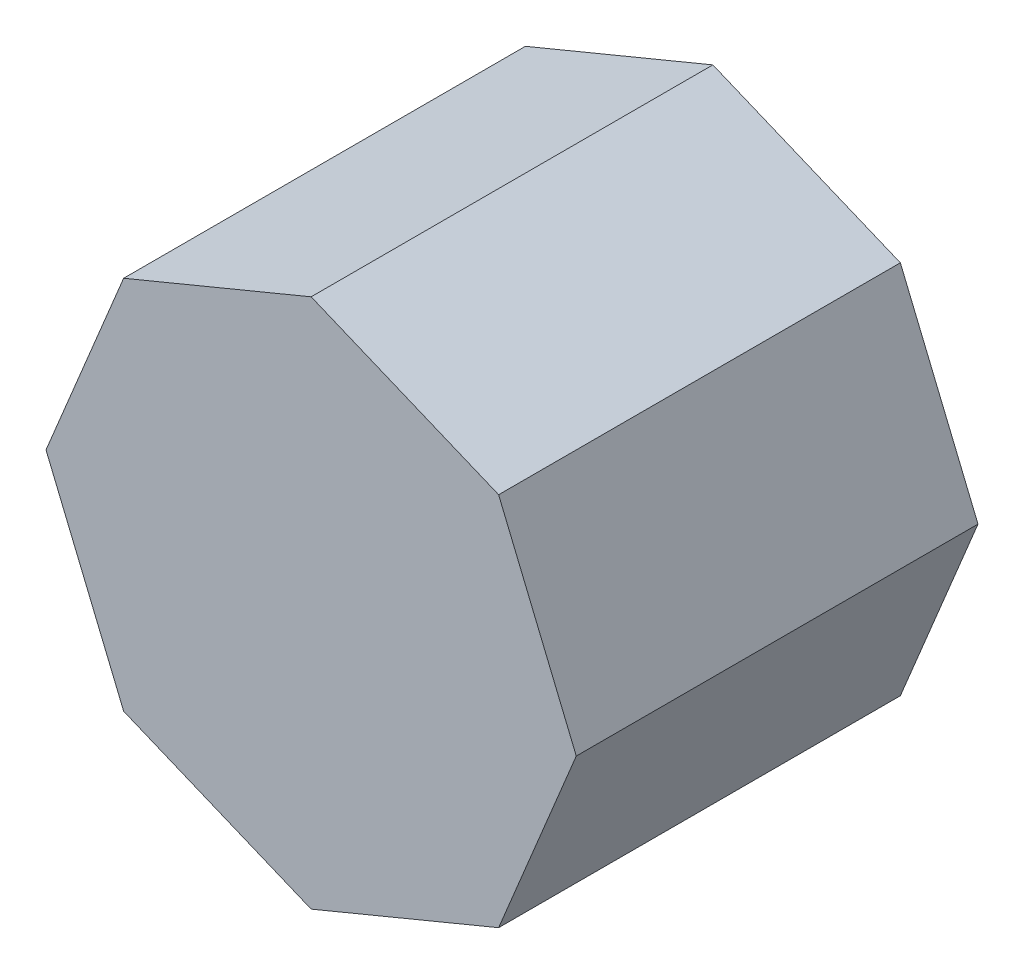
ISO-10303-21;
HEADER;
FILE_DESCRIPTION(('STEP AP214'),'2;1');
FILE_NAME('part.step','',(''),(''),'','','');
FILE_SCHEMA(('AUTOMOTIVE_DESIGN { 1 0 10303 214 1 1 1 1 }'));
ENDSEC;
DATA;
#1=APPLICATION_CONTEXT('core data for automotive mechanical design processes');
#2=APPLICATION_PROTOCOL_DEFINITION('international standard','automotive_design',2000,#1);
#3=PRODUCT_CONTEXT('',#1,'mechanical');
#4=PRODUCT('Part','Part','',(#3));
#5=PRODUCT_RELATED_PRODUCT_CATEGORY('part','',(#4));
#6=PRODUCT_DEFINITION_FORMATION('','',#4);
#7=PRODUCT_DEFINITION_CONTEXT('part definition',#1,'design');
#8=PRODUCT_DEFINITION('design','',#6,#7);
#9=PRODUCT_DEFINITION_SHAPE('','',#8);
#10=(LENGTH_UNIT() NAMED_UNIT(*) SI_UNIT(.MILLI.,.METRE.));
#11=(NAMED_UNIT(*) PLANE_ANGLE_UNIT() SI_UNIT($,.RADIAN.));
#12=(NAMED_UNIT(*) SI_UNIT($,.STERADIAN.) SOLID_ANGLE_UNIT());
#13=UNCERTAINTY_MEASURE_WITH_UNIT(LENGTH_MEASURE(1.E-05),#10,'distance_accuracy_value','');
#14=(GEOMETRIC_REPRESENTATION_CONTEXT(3) GLOBAL_UNCERTAINTY_ASSIGNED_CONTEXT((#13)) GLOBAL_UNIT_ASSIGNED_CONTEXT((#10,
#11,#12)) REPRESENTATION_CONTEXT('',''));
#15=CARTESIAN_POINT('',(0.,0.,0.));
#16=DIRECTION('',(0.,0.,1.));
#17=DIRECTION('',(1.,0.,0.));
#18=AXIS2_PLACEMENT_3D('',#15,#16,#17);
#19=CARTESIAN_POINT('',(-0.1374648,-0.381,0.20828));
#20=DIRECTION('',(0.,0.,-1.));
#21=DIRECTION('',(0.,-1.,0.));
#22=AXIS2_PLACEMENT_3D('',#19,#20,#21);
#23=PLANE('',#22);
#24=DIRECTION('',(0.382672329254966,-0.92388413149192,0.));
#25=VECTOR('',#24,1.);
#26=CARTESIAN_POINT('',(-0.1374648,-0.381,0.20828));
#27=LINE('',#26,#25);
#28=CARTESIAN_POINT('',(-0.1374648,-0.381,0.20828));
#29=VERTEX_POINT('',#28);
#30=CARTESIAN_POINT('',(-0.09720326,-0.47820326,0.20828));
#31=VERTEX_POINT('',#30);
#32=EDGE_CURVE('E136',#29,#31,#27,.T.);
#33=ORIENTED_EDGE('',*,*,#32,.T.);
#34=DIRECTION('',(0.92388413149192,-0.382672329254966,0.));
#35=VECTOR('',#34,1.);
#36=CARTESIAN_POINT('',(-0.09720326,-0.47820326,0.20828));
#37=LINE('',#36,#35);
#38=CARTESIAN_POINT('',(0.,-0.5184648,0.20828));
#39=VERTEX_POINT('',#38);
#40=EDGE_CURVE('E131',#31,#39,#37,.T.);
#41=ORIENTED_EDGE('',*,*,#40,.T.);
#42=DIRECTION('',(0.92388413149192,0.382672329254966,0.));
#43=VECTOR('',#42,1.);
#44=CARTESIAN_POINT('',(0.,-0.5184648,0.20828));
#45=LINE('',#44,#43);
#46=CARTESIAN_POINT('',(0.09720326,-0.47820326,0.20828));
#47=VERTEX_POINT('',#46);
#48=EDGE_CURVE('E21',#39,#47,#45,.T.);
#49=ORIENTED_EDGE('',*,*,#48,.T.);
#50=DIRECTION('',(0.382672329254966,0.92388413149192,0.));
#51=VECTOR('',#50,1.);
#52=CARTESIAN_POINT('',(0.09720326,-0.47820326,0.20828));
#53=LINE('',#52,#51);
#54=CARTESIAN_POINT('',(0.1374648,-0.381,0.20828));
#55=VERTEX_POINT('',#54);
#56=EDGE_CURVE('E90',#47,#55,#53,.T.);
#57=ORIENTED_EDGE('',*,*,#56,.T.);
#58=DIRECTION('',(-0.382672329254966,0.92388413149192,0.));
#59=VECTOR('',#58,1.);
#60=CARTESIAN_POINT('',(0.1374648,-0.381,0.20828));
#61=LINE('',#60,#59);
#62=CARTESIAN_POINT('',(0.09720326,-0.28379674,0.20828));
#63=VERTEX_POINT('',#62);
#64=EDGE_CURVE('E160',#55,#63,#61,.T.);
#65=ORIENTED_EDGE('',*,*,#64,.T.);
#66=DIRECTION('',(-0.92388413149192,0.382672329254966,0.));
#67=VECTOR('',#66,1.);
#68=CARTESIAN_POINT('',(0.09720326,-0.28379674,0.20828));
#69=LINE('',#68,#67);
#70=CARTESIAN_POINT('',(0.,-0.2435352,0.20828));
#71=VERTEX_POINT('',#70);
#72=EDGE_CURVE('E166',#63,#71,#69,.T.);
#73=ORIENTED_EDGE('',*,*,#72,.T.);
#74=DIRECTION('',(-0.92388413149192,-0.382672329254966,0.));
#75=VECTOR('',#74,1.);
#76=CARTESIAN_POINT('',(0.,-0.2435352,0.20828));
#77=LINE('',#76,#75);
#78=CARTESIAN_POINT('',(-0.09720326,-0.28379674,0.20828));
#79=VERTEX_POINT('',#78);
#80=EDGE_CURVE('E179',#71,#79,#77,.T.);
#81=ORIENTED_EDGE('',*,*,#80,.T.);
#82=DIRECTION('',(-0.382672329254966,-0.92388413149192,0.));
#83=VECTOR('',#82,1.);
#84=CARTESIAN_POINT('',(-0.09720326,-0.28379674,0.20828));
#85=LINE('',#84,#83);
#86=EDGE_CURVE('E11',#79,#29,#85,.T.);
#87=ORIENTED_EDGE('',*,*,#86,.T.);
#88=EDGE_LOOP('',(#33,#41,#49,#57,#65,#73,#81,#87));
#89=FACE_BOUND('',#88,.T.);
#90=ADVANCED_FACE('F17',(#89),#23,.F.);
#91=CARTESIAN_POINT('',(-0.1374648,-0.381,0.));
#92=DIRECTION('',(0.,0.,-1.));
#93=DIRECTION('',(0.,-1.,0.));
#94=AXIS2_PLACEMENT_3D('',#91,#92,#93);
#95=PLANE('',#94);
#96=DIRECTION('',(-0.382672329254966,-0.92388413149192,0.));
#97=VECTOR('',#96,1.);
#98=CARTESIAN_POINT('',(-0.09720326,-0.28379674,0.));
#99=LINE('',#98,#97);
#100=CARTESIAN_POINT('',(-0.09720326,-0.28379674,0.));
#101=VERTEX_POINT('',#100);
#102=CARTESIAN_POINT('',(-0.1374648,-0.381,0.));
#103=VERTEX_POINT('',#102);
#104=EDGE_CURVE('E28',#101,#103,#99,.T.);
#105=ORIENTED_EDGE('',*,*,#104,.F.);
#106=DIRECTION('',(-0.92388413149192,-0.382672329254966,0.));
#107=VECTOR('',#106,1.);
#108=CARTESIAN_POINT('',(0.,-0.2435352,0.));
#109=LINE('',#108,#107);
#110=CARTESIAN_POINT('',(0.,-0.2435352,0.));
#111=VERTEX_POINT('',#110);
#112=EDGE_CURVE('E161',#111,#101,#109,.T.);
#113=ORIENTED_EDGE('',*,*,#112,.F.);
#114=DIRECTION('',(-0.92388413149192,0.382672329254966,0.));
#115=VECTOR('',#114,1.);
#116=CARTESIAN_POINT('',(0.09720326,-0.28379674,0.));
#117=LINE('',#116,#115);
#118=CARTESIAN_POINT('',(0.09720326,-0.28379674,0.));
#119=VERTEX_POINT('',#118);
#120=EDGE_CURVE('E175',#119,#111,#117,.T.);
#121=ORIENTED_EDGE('',*,*,#120,.F.);
#122=DIRECTION('',(-0.382672329254966,0.92388413149192,0.));
#123=VECTOR('',#122,1.);
#124=CARTESIAN_POINT('',(0.1374648,-0.381,0.));
#125=LINE('',#124,#123);
#126=CARTESIAN_POINT('',(0.1374648,-0.381,0.));
#127=VERTEX_POINT('',#126);
#128=EDGE_CURVE('E80',#127,#119,#125,.T.);
#129=ORIENTED_EDGE('',*,*,#128,.F.);
#130=DIRECTION('',(0.382672329254966,0.92388413149192,0.));
#131=VECTOR('',#130,1.);
#132=CARTESIAN_POINT('',(0.09720326,-0.47820326,0.));
#133=LINE('',#132,#131);
#134=CARTESIAN_POINT('',(0.09720326,-0.47820326,0.));
#135=VERTEX_POINT('',#134);
#136=EDGE_CURVE('E99',#135,#127,#133,.T.);
#137=ORIENTED_EDGE('',*,*,#136,.F.);
#138=DIRECTION('',(0.92388413149192,0.382672329254966,0.));
#139=VECTOR('',#138,1.);
#140=CARTESIAN_POINT('',(0.,-0.5184648,0.));
#141=LINE('',#140,#139);
#142=CARTESIAN_POINT('',(0.,-0.5184648,0.));
#143=VERTEX_POINT('',#142);
#144=EDGE_CURVE('E120',#143,#135,#141,.T.);
#145=ORIENTED_EDGE('',*,*,#144,.F.);
#146=DIRECTION('',(0.92388413149192,-0.382672329254966,0.));
#147=VECTOR('',#146,1.);
#148=CARTESIAN_POINT('',(-0.09720326,-0.47820326,0.));
#149=LINE('',#148,#147);
#150=CARTESIAN_POINT('',(-0.09720326,-0.47820326,0.));
#151=VERTEX_POINT('',#150);
#152=EDGE_CURVE('E114',#151,#143,#149,.T.);
#153=ORIENTED_EDGE('',*,*,#152,.F.);
#154=DIRECTION('',(0.382672329254966,-0.92388413149192,0.));
#155=VECTOR('',#154,1.);
#156=CARTESIAN_POINT('',(-0.1374648,-0.381,0.));
#157=LINE('',#156,#155);
#158=EDGE_CURVE('E118',#103,#151,#157,.T.);
#159=ORIENTED_EDGE('',*,*,#158,.F.);
#160=EDGE_LOOP('',(#105,#113,#121,#129,#137,#145,#153,#159));
#161=FACE_BOUND('',#160,.T.);
#162=ADVANCED_FACE('F116',(#161),#95,.T.);
#163=CARTESIAN_POINT('',(-0.09720326,-0.28379674,0.));
#164=DIRECTION('',(0.92388413149192,-0.382672329254966,0.));
#165=DIRECTION('',(0.,0.,-1.));
#166=AXIS2_PLACEMENT_3D('',#163,#164,#165);
#167=PLANE('',#166);
#168=ORIENTED_EDGE('',*,*,#104,.T.);
#169=DIRECTION('',(0.,0.,1.));
#170=VECTOR('',#169,1.);
#171=CARTESIAN_POINT('',(-0.1374648,-0.381,0.));
#172=LINE('',#171,#170);
#173=EDGE_CURVE('E126',#103,#29,#172,.T.);
#174=ORIENTED_EDGE('',*,*,#173,.T.);
#175=ORIENTED_EDGE('',*,*,#86,.F.);
#176=DIRECTION('',(0.,0.,1.));
#177=VECTOR('',#176,1.);
#178=CARTESIAN_POINT('',(-0.09720326,-0.28379674,0.));
#179=LINE('',#178,#177);
#180=EDGE_CURVE('E165',#101,#79,#179,.T.);
#181=ORIENTED_EDGE('',*,*,#180,.F.);
#182=EDGE_LOOP('',(#168,#174,#175,#181));
#183=FACE_BOUND('',#182,.T.);
#184=ADVANCED_FACE('F208',(#183),#167,.F.);
#185=CARTESIAN_POINT('',(0.,-0.2435352,0.));
#186=DIRECTION('',(0.382672329254966,-0.92388413149192,0.));
#187=DIRECTION('',(0.,0.,-1.));
#188=AXIS2_PLACEMENT_3D('',#185,#186,#187);
#189=PLANE('',#188);
#190=ORIENTED_EDGE('',*,*,#112,.T.);
#191=ORIENTED_EDGE('',*,*,#180,.T.);
#192=ORIENTED_EDGE('',*,*,#80,.F.);
#193=DIRECTION('',(0.,0.,1.));
#194=VECTOR('',#193,1.);
#195=CARTESIAN_POINT('',(0.,-0.2435352,0.));
#196=LINE('',#195,#194);
#197=EDGE_CURVE('E171',#111,#71,#196,.T.);
#198=ORIENTED_EDGE('',*,*,#197,.F.);
#199=EDGE_LOOP('',(#190,#191,#192,#198));
#200=FACE_BOUND('',#199,.T.);
#201=ADVANCED_FACE('F207',(#200),#189,.F.);
#202=CARTESIAN_POINT('',(0.09720326,-0.28379674,0.));
#203=DIRECTION('',(-0.382672329254966,-0.92388413149192,0.));
#204=DIRECTION('',(-0.92388413149192,0.382672329254966,0.));
#205=AXIS2_PLACEMENT_3D('',#202,#203,#204);
#206=PLANE('',#205);
#207=ORIENTED_EDGE('',*,*,#120,.T.);
#208=ORIENTED_EDGE('',*,*,#197,.T.);
#209=ORIENTED_EDGE('',*,*,#72,.F.);
#210=DIRECTION('',(0.,0.,1.));
#211=VECTOR('',#210,1.);
#212=CARTESIAN_POINT('',(0.09720326,-0.28379674,0.));
#213=LINE('',#212,#211);
#214=EDGE_CURVE('E156',#119,#63,#213,.T.);
#215=ORIENTED_EDGE('',*,*,#214,.F.);
#216=EDGE_LOOP('',(#207,#208,#209,#215));
#217=FACE_BOUND('',#216,.T.);
#218=ADVANCED_FACE('F204',(#217),#206,.F.);
#219=CARTESIAN_POINT('',(0.1374648,-0.381,0.));
#220=DIRECTION('',(-0.92388413149192,-0.382672329254966,0.));
#221=DIRECTION('',(-0.382672329254966,0.92388413149192,0.));
#222=AXIS2_PLACEMENT_3D('',#219,#220,#221);
#223=PLANE('',#222);
#224=ORIENTED_EDGE('',*,*,#128,.T.);
#225=ORIENTED_EDGE('',*,*,#214,.T.);
#226=ORIENTED_EDGE('',*,*,#64,.F.);
#227=DIRECTION('',(0.,0.,1.));
#228=VECTOR('',#227,1.);
#229=CARTESIAN_POINT('',(0.1374648,-0.381,0.));
#230=LINE('',#229,#228);
#231=EDGE_CURVE('E153',#127,#55,#230,.T.);
#232=ORIENTED_EDGE('',*,*,#231,.F.);
#233=EDGE_LOOP('',(#224,#225,#226,#232));
#234=FACE_BOUND('',#233,.T.);
#235=ADVANCED_FACE('F202',(#234),#223,.F.);
#236=CARTESIAN_POINT('',(0.09720326,-0.47820326,0.));
#237=DIRECTION('',(-0.92388413149192,0.382672329254966,0.));
#238=DIRECTION('',(0.,0.,1.));
#239=AXIS2_PLACEMENT_3D('',#236,#237,#238);
#240=PLANE('',#239);
#241=ORIENTED_EDGE('',*,*,#136,.T.);
#242=ORIENTED_EDGE('',*,*,#231,.T.);
#243=ORIENTED_EDGE('',*,*,#56,.F.);
#244=DIRECTION('',(0.,0.,1.));
#245=VECTOR('',#244,1.);
#246=CARTESIAN_POINT('',(0.09720326,-0.47820326,0.));
#247=LINE('',#246,#245);
#248=EDGE_CURVE('E147',#135,#47,#247,.T.);
#249=ORIENTED_EDGE('',*,*,#248,.F.);
#250=EDGE_LOOP('',(#241,#242,#243,#249));
#251=FACE_BOUND('',#250,.T.);
#252=ADVANCED_FACE('F315',(#251),#240,.F.);
#253=CARTESIAN_POINT('',(0.,-0.5184648,0.));
#254=DIRECTION('',(-0.382672329254966,0.92388413149192,0.));
#255=DIRECTION('',(0.,0.,1.));
#256=AXIS2_PLACEMENT_3D('',#253,#254,#255);
#257=PLANE('',#256);
#258=ORIENTED_EDGE('',*,*,#144,.T.);
#259=ORIENTED_EDGE('',*,*,#248,.T.);
#260=ORIENTED_EDGE('',*,*,#48,.F.);
#261=DIRECTION('',(0.,0.,1.));
#262=VECTOR('',#261,1.);
#263=CARTESIAN_POINT('',(0.,-0.5184648,0.));
#264=LINE('',#263,#262);
#265=EDGE_CURVE('E125',#143,#39,#264,.T.);
#266=ORIENTED_EDGE('',*,*,#265,.F.);
#267=EDGE_LOOP('',(#258,#259,#260,#266));
#268=FACE_BOUND('',#267,.T.);
#269=ADVANCED_FACE('F320',(#268),#257,.F.);
#270=CARTESIAN_POINT('',(-0.09720326,-0.47820326,0.));
#271=DIRECTION('',(0.382672329254966,0.92388413149192,0.));
#272=DIRECTION('',(0.,0.,-1.));
#273=AXIS2_PLACEMENT_3D('',#270,#271,#272);
#274=PLANE('',#273);
#275=ORIENTED_EDGE('',*,*,#152,.T.);
#276=ORIENTED_EDGE('',*,*,#265,.T.);
#277=ORIENTED_EDGE('',*,*,#40,.F.);
#278=DIRECTION('',(0.,0.,1.));
#279=VECTOR('',#278,1.);
#280=CARTESIAN_POINT('',(-0.09720326,-0.47820326,0.));
#281=LINE('',#280,#279);
#282=EDGE_CURVE('E129',#151,#31,#281,.T.);
#283=ORIENTED_EDGE('',*,*,#282,.F.);
#284=EDGE_LOOP('',(#275,#276,#277,#283));
#285=FACE_BOUND('',#284,.T.);
#286=ADVANCED_FACE('F19',(#285),#274,.F.);
#287=CARTESIAN_POINT('',(-0.1374648,-0.381,0.));
#288=DIRECTION('',(0.92388413149192,0.382672329254966,0.));
#289=DIRECTION('',(0.,0.,-1.));
#290=AXIS2_PLACEMENT_3D('',#287,#288,#289);
#291=PLANE('',#290);
#292=ORIENTED_EDGE('',*,*,#158,.T.);
#293=ORIENTED_EDGE('',*,*,#282,.T.);
#294=ORIENTED_EDGE('',*,*,#32,.F.);
#295=ORIENTED_EDGE('',*,*,#173,.F.);
#296=EDGE_LOOP('',(#292,#293,#294,#295));
#297=FACE_BOUND('',#296,.T.);
#298=ADVANCED_FACE('F139',(#297),#291,.F.);
#299=CLOSED_SHELL('',(#90,#162,#184,#201,#218,#235,#252,#269,#286,#298));
#300=MANIFOLD_SOLID_BREP('B1',#299);
#301=ADVANCED_BREP_SHAPE_REPRESENTATION('',(#18,#300),#14);
#302=SHAPE_DEFINITION_REPRESENTATION(#9,#301);
ENDSEC;
END-ISO-10303-21;
